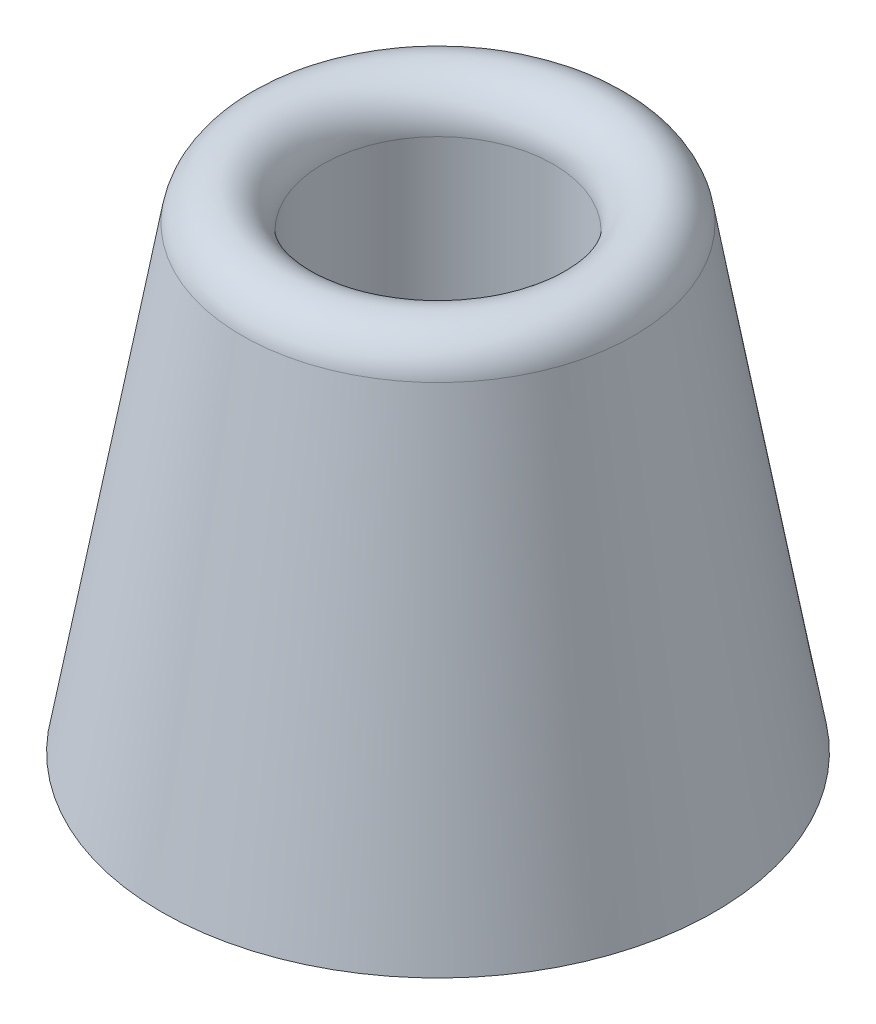
ISO-10303-21;
HEADER;
FILE_DESCRIPTION(('STEP AP214'),'2;1');
FILE_NAME('part.step','',(''),(''),'','','');
FILE_SCHEMA(('AUTOMOTIVE_DESIGN { 1 0 10303 214 1 1 1 1 }'));
ENDSEC;
DATA;
#1=APPLICATION_CONTEXT('core data for automotive mechanical design processes');
#2=APPLICATION_PROTOCOL_DEFINITION('international standard','automotive_design',2000,#1);
#3=PRODUCT_CONTEXT('',#1,'mechanical');
#4=PRODUCT('Part','Part','',(#3));
#5=PRODUCT_RELATED_PRODUCT_CATEGORY('part','',(#4));
#6=PRODUCT_DEFINITION_FORMATION('','',#4);
#7=PRODUCT_DEFINITION_CONTEXT('part definition',#1,'design');
#8=PRODUCT_DEFINITION('design','',#6,#7);
#9=PRODUCT_DEFINITION_SHAPE('','',#8);
#10=(LENGTH_UNIT() NAMED_UNIT(*) SI_UNIT(.MILLI.,.METRE.));
#11=(NAMED_UNIT(*) PLANE_ANGLE_UNIT() SI_UNIT($,.RADIAN.));
#12=(NAMED_UNIT(*) SI_UNIT($,.STERADIAN.) SOLID_ANGLE_UNIT());
#13=UNCERTAINTY_MEASURE_WITH_UNIT(LENGTH_MEASURE(1.E-05),#10,'distance_accuracy_value','');
#14=(GEOMETRIC_REPRESENTATION_CONTEXT(3) GLOBAL_UNCERTAINTY_ASSIGNED_CONTEXT((#13)) GLOBAL_UNIT_ASSIGNED_CONTEXT((#10,
#11,#12)) REPRESENTATION_CONTEXT('',''));
#15=CARTESIAN_POINT('',(0.,0.,0.));
#16=DIRECTION('',(0.,0.,1.));
#17=DIRECTION('',(1.,0.,0.));
#18=AXIS2_PLACEMENT_3D('',#15,#16,#17);
#19=CARTESIAN_POINT('',(0.,0.,0.));
#20=DIRECTION('',(0.,-1.,0.));
#21=DIRECTION('',(0.,0.,-1.));
#22=AXIS2_PLACEMENT_3D('',#19,#20,#21);
#23=CONICAL_SURFACE('',#22,14.2875,0.174532925199434);
#24=CARTESIAN_POINT('',(0.,23.667554611704,0.));
#25=DIRECTION('',(0.,-1.,0.));
#26=DIRECTION('',(0.,0.,-1.));
#27=AXIS2_PLACEMENT_3D('',#24,#25,#26);
#28=CIRCLE('',#27,10.1142715545655);
#29=CARTESIAN_POINT('',(0.,23.667554611704,-10.1142715545655));
#30=VERTEX_POINT('',#29);
#31=EDGE_CURVE('E61',#30,#30,#28,.T.);
#32=ORIENTED_EDGE('',*,*,#31,.T.);
#33=EDGE_LOOP('',(#32));
#34=FACE_BOUND('',#33,.T.);
#35=CARTESIAN_POINT('',(0.,0.,0.));
#36=DIRECTION('',(0.,-1.,0.));
#37=DIRECTION('',(0.,0.,-1.));
#38=AXIS2_PLACEMENT_3D('',#35,#36,#37);
#39=CIRCLE('',#38,14.2875);
#40=CARTESIAN_POINT('',(0.,0.,-14.2875));
#41=VERTEX_POINT('',#40);
#42=EDGE_CURVE('E10',#41,#41,#39,.T.);
#43=ORIENTED_EDGE('',*,*,#42,.F.);
#44=EDGE_LOOP('',(#43));
#45=FACE_BOUND('',#44,.T.);
#46=ADVANCED_FACE('F34',(#34,#45),#23,.T.);
#47=CARTESIAN_POINT('',(14.2875,0.,0.));
#48=DIRECTION('',(0.,-1.,0.));
#49=DIRECTION('',(0.,0.,-1.));
#50=AXIS2_PLACEMENT_3D('',#47,#48,#49);
#51=PLANE('',#50);
#52=ORIENTED_EDGE('',*,*,#42,.T.);
#53=EDGE_LOOP('',(#52));
#54=FACE_BOUND('',#53,.T.);
#55=CARTESIAN_POINT('',(0.,0.,0.));
#56=DIRECTION('',(0.,-1.,0.));
#57=DIRECTION('',(0.,0.,-1.));
#58=AXIS2_PLACEMENT_3D('',#55,#56,#57);
#59=CIRCLE('',#58,3.175);
#60=CARTESIAN_POINT('',(0.,0.,-3.175));
#61=VERTEX_POINT('',#60);
#62=EDGE_CURVE('E41',#61,#61,#59,.T.);
#63=ORIENTED_EDGE('',*,*,#62,.F.);
#64=EDGE_LOOP('',(#63));
#65=FACE_BOUND('',#64,.T.);
#66=ADVANCED_FACE('F80',(#54,#65),#51,.T.);
#67=CARTESIAN_POINT('',(0.,0.,0.));
#68=DIRECTION('',(0.,-1.,0.));
#69=DIRECTION('',(0.,0.,-1.));
#70=AXIS2_PLACEMENT_3D('',#67,#68,#69);
#71=CYLINDRICAL_SURFACE('',#70,3.175);
#72=ORIENTED_EDGE('',*,*,#62,.T.);
#73=EDGE_LOOP('',(#72));
#74=FACE_BOUND('',#73,.T.);
#75=CARTESIAN_POINT('',(0.,13.890625,0.));
#76=DIRECTION('',(0.,-1.,0.));
#77=DIRECTION('',(0.,0.,-1.));
#78=AXIS2_PLACEMENT_3D('',#75,#76,#77);
#79=CIRCLE('',#78,3.175);
#80=CARTESIAN_POINT('',(0.,13.890625,-3.175));
#81=VERTEX_POINT('',#80);
#82=EDGE_CURVE('E46',#81,#81,#79,.T.);
#83=ORIENTED_EDGE('',*,*,#82,.F.);
#84=EDGE_LOOP('',(#83));
#85=FACE_BOUND('',#84,.T.);
#86=ADVANCED_FACE('F84',(#74,#85),#71,.F.);
#87=CARTESIAN_POINT('',(3.175,13.890625,0.));
#88=DIRECTION('',(0.,1.,0.));
#89=DIRECTION('',(0.,0.,1.));
#90=AXIS2_PLACEMENT_3D('',#87,#88,#89);
#91=PLANE('',#90);
#92=ORIENTED_EDGE('',*,*,#82,.T.);
#93=EDGE_LOOP('',(#92));
#94=FACE_BOUND('',#93,.T.);
#95=CARTESIAN_POINT('',(0.,13.890625,0.));
#96=DIRECTION('',(0.,-1.,0.));
#97=DIRECTION('',(0.,0.,-1.));
#98=AXIS2_PLACEMENT_3D('',#95,#96,#97);
#99=CIRCLE('',#98,5.953125);
#100=CARTESIAN_POINT('',(0.,13.890625,-5.953125));
#101=VERTEX_POINT('',#100);
#102=EDGE_CURVE('E52',#101,#101,#99,.T.);
#103=ORIENTED_EDGE('',*,*,#102,.F.);
#104=EDGE_LOOP('',(#103));
#105=FACE_BOUND('',#104,.T.);
#106=ADVANCED_FACE('F76',(#94,#105),#91,.T.);
#107=CARTESIAN_POINT('',(0.,0.,0.));
#108=DIRECTION('',(0.,-1.,0.));
#109=DIRECTION('',(0.,0.,-1.));
#110=AXIS2_PLACEMENT_3D('',#107,#108,#109);
#111=CYLINDRICAL_SURFACE('',#110,5.953125);
#112=ORIENTED_EDGE('',*,*,#102,.T.);
#113=EDGE_LOOP('',(#112));
#114=FACE_BOUND('',#113,.T.);
#115=CARTESIAN_POINT('',(0.,23.3035014609095,0.));
#116=DIRECTION('',(0.,-1.,0.));
#117=DIRECTION('',(0.,0.,-1.));
#118=AXIS2_PLACEMENT_3D('',#115,#116,#117);
#119=CIRCLE('',#118,5.953125);
#120=CARTESIAN_POINT('',(0.,23.3035014609095,-5.953125));
#121=VERTEX_POINT('',#120);
#122=EDGE_CURVE('E57',#121,#121,#119,.T.);
#123=ORIENTED_EDGE('',*,*,#122,.F.);
#124=EDGE_LOOP('',(#123));
#125=FACE_BOUND('',#124,.T.);
#126=ADVANCED_FACE('F70',(#114,#125),#111,.F.);
#127=CARTESIAN_POINT('',(0.,23.3035014609095,0.));
#128=DIRECTION('',(0.,-1.,0.));
#129=DIRECTION('',(0.,0.,-1.));
#130=AXIS2_PLACEMENT_3D('',#127,#128,#129);
#131=TOROIDAL_SURFACE('',#130,8.04962353909046,2.09649853909046);
#132=ORIENTED_EDGE('',*,*,#122,.T.);
#133=EDGE_LOOP('',(#132));
#134=FACE_BOUND('',#133,.T.);
#135=ORIENTED_EDGE('',*,*,#31,.F.);
#136=EDGE_LOOP('',(#135));
#137=FACE_BOUND('',#136,.T.);
#138=ADVANCED_FACE('F68',(#134,#137),#131,.T.);
#139=CLOSED_SHELL('',(#46,#66,#86,#106,#126,#138));
#140=MANIFOLD_SOLID_BREP('B2',#139);
#141=ADVANCED_BREP_SHAPE_REPRESENTATION('',(#18,#140),#14);
#142=SHAPE_DEFINITION_REPRESENTATION(#9,#141);
ENDSEC;
END-ISO-10303-21;
